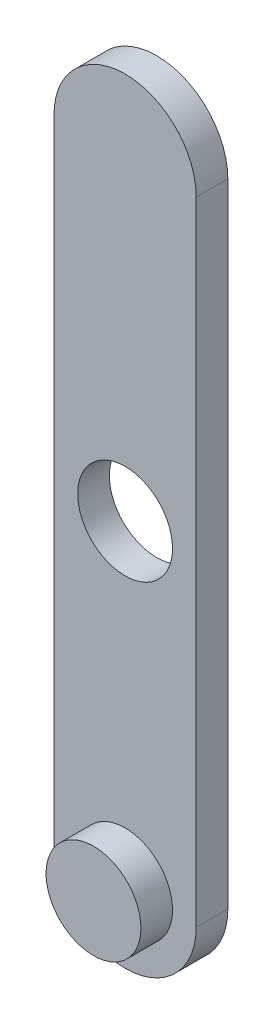
ISO-10303-21;
HEADER;
FILE_DESCRIPTION(('STEP AP214'),'2;1');
FILE_NAME('part.step','',(''),(''),'','','');
FILE_SCHEMA(('AUTOMOTIVE_DESIGN { 1 0 10303 214 1 1 1 1 }'));
ENDSEC;
DATA;
#1=APPLICATION_CONTEXT('core data for automotive mechanical design processes');
#2=APPLICATION_PROTOCOL_DEFINITION('international standard','automotive_design',2000,#1);
#3=PRODUCT_CONTEXT('',#1,'mechanical');
#4=PRODUCT('Part','Part','',(#3));
#5=PRODUCT_RELATED_PRODUCT_CATEGORY('part','',(#4));
#6=PRODUCT_DEFINITION_FORMATION('','',#4);
#7=PRODUCT_DEFINITION_CONTEXT('part definition',#1,'design');
#8=PRODUCT_DEFINITION('design','',#6,#7);
#9=PRODUCT_DEFINITION_SHAPE('','',#8);
#10=(LENGTH_UNIT() NAMED_UNIT(*) SI_UNIT(.MILLI.,.METRE.));
#11=(NAMED_UNIT(*) PLANE_ANGLE_UNIT() SI_UNIT($,.RADIAN.));
#12=(NAMED_UNIT(*) SI_UNIT($,.STERADIAN.) SOLID_ANGLE_UNIT());
#13=UNCERTAINTY_MEASURE_WITH_UNIT(LENGTH_MEASURE(1.E-05),#10,'distance_accuracy_value','');
#14=(GEOMETRIC_REPRESENTATION_CONTEXT(3) GLOBAL_UNCERTAINTY_ASSIGNED_CONTEXT((#13)) GLOBAL_UNIT_ASSIGNED_CONTEXT((#10,
#11,#12)) REPRESENTATION_CONTEXT('',''));
#15=CARTESIAN_POINT('',(0.,0.,0.));
#16=DIRECTION('',(0.,0.,1.));
#17=DIRECTION('',(1.,0.,0.));
#18=AXIS2_PLACEMENT_3D('',#15,#16,#17);
#19=CARTESIAN_POINT('',(0.,-20.,2.));
#20=DIRECTION('',(0.,0.,1.));
#21=DIRECTION('',(1.,0.,0.));
#22=AXIS2_PLACEMENT_3D('',#19,#20,#21);
#23=PLANE('',#22);
#24=CARTESIAN_POINT('',(0.,-19.8046686812946,2.));
#25=DIRECTION('',(0.,0.,1.));
#26=DIRECTION('',(1.,0.,0.));
#27=AXIS2_PLACEMENT_3D('',#24,#25,#26);
#28=CIRCLE('',#27,3.);
#29=CARTESIAN_POINT('',(3.,-19.8046686812946,2.));
#30=VERTEX_POINT('',#29);
#31=EDGE_CURVE('E124',#30,#30,#28,.T.);
#32=ORIENTED_EDGE('',*,*,#31,.F.);
#33=EDGE_LOOP('',(#32));
#34=FACE_BOUND('',#33,.T.);
#35=CARTESIAN_POINT('',(0.,-20.,2.));
#36=DIRECTION('',(0.,0.,1.));
#37=DIRECTION('',(1.,0.,0.));
#38=AXIS2_PLACEMENT_3D('',#35,#36,#37);
#39=CIRCLE('',#38,4.5);
#40=CARTESIAN_POINT('',(-4.5,-20.,2.));
#41=VERTEX_POINT('',#40);
#42=CARTESIAN_POINT('',(4.5,-20.,2.));
#43=VERTEX_POINT('',#42);
#44=EDGE_CURVE('E91',#41,#43,#39,.T.);
#45=ORIENTED_EDGE('',*,*,#44,.T.);
#46=DIRECTION('',(0.,1.,0.));
#47=VECTOR('',#46,1.);
#48=CARTESIAN_POINT('',(4.5,-20.,2.));
#49=LINE('',#48,#47);
#50=CARTESIAN_POINT('',(4.49999999999999,20.,2.));
#51=VERTEX_POINT('',#50);
#52=EDGE_CURVE('E86',#43,#51,#49,.T.);
#53=ORIENTED_EDGE('',*,*,#52,.T.);
#54=CARTESIAN_POINT('',(0.,20.,2.));
#55=DIRECTION('',(0.,0.,1.));
#56=DIRECTION('',(1.,0.,0.));
#57=AXIS2_PLACEMENT_3D('',#54,#55,#56);
#58=CIRCLE('',#57,4.5);
#59=CARTESIAN_POINT('',(-4.50000000000001,20.,2.));
#60=VERTEX_POINT('',#59);
#61=EDGE_CURVE('E89',#51,#60,#58,.T.);
#62=ORIENTED_EDGE('',*,*,#61,.T.);
#63=DIRECTION('',(0.,-1.,0.));
#64=VECTOR('',#63,1.);
#65=CARTESIAN_POINT('',(-4.5,-20.,2.));
#66=LINE('',#65,#64);
#67=EDGE_CURVE('E56',#60,#41,#66,.T.);
#68=ORIENTED_EDGE('',*,*,#67,.T.);
#69=EDGE_LOOP('',(#45,#53,#62,#68));
#70=FACE_BOUND('',#69,.T.);
#71=CARTESIAN_POINT('',(0.,0.,2.));
#72=DIRECTION('',(0.,0.,1.));
#73=DIRECTION('',(1.,0.,0.));
#74=AXIS2_PLACEMENT_3D('',#71,#72,#73);
#75=CIRCLE('',#74,3.);
#76=CARTESIAN_POINT('',(3.,0.,2.));
#77=VERTEX_POINT('',#76);
#78=EDGE_CURVE('E106',#77,#77,#75,.T.);
#79=ORIENTED_EDGE('',*,*,#78,.F.);
#80=EDGE_LOOP('',(#79));
#81=FACE_BOUND('',#80,.T.);
#82=ADVANCED_FACE('F39',(#34,#70,#81),#23,.T.);
#83=CARTESIAN_POINT('',(0.,-20.,0.));
#84=DIRECTION('',(0.,0.,1.));
#85=DIRECTION('',(1.,0.,0.));
#86=AXIS2_PLACEMENT_3D('',#83,#84,#85);
#87=PLANE('',#86);
#88=CARTESIAN_POINT('',(0.,-20.,0.));
#89=DIRECTION('',(0.,0.,1.));
#90=DIRECTION('',(1.,0.,0.));
#91=AXIS2_PLACEMENT_3D('',#88,#89,#90);
#92=CIRCLE('',#91,4.5);
#93=CARTESIAN_POINT('',(-4.5,-20.,0.));
#94=VERTEX_POINT('',#93);
#95=CARTESIAN_POINT('',(4.5,-20.,0.));
#96=VERTEX_POINT('',#95);
#97=EDGE_CURVE('E103',#94,#96,#92,.T.);
#98=ORIENTED_EDGE('',*,*,#97,.F.);
#99=DIRECTION('',(0.,-1.,0.));
#100=VECTOR('',#99,1.);
#101=CARTESIAN_POINT('',(-4.5,-20.,0.));
#102=LINE('',#101,#100);
#103=CARTESIAN_POINT('',(-4.50000000000001,20.,0.));
#104=VERTEX_POINT('',#103);
#105=EDGE_CURVE('E79',#104,#94,#102,.T.);
#106=ORIENTED_EDGE('',*,*,#105,.F.);
#107=CARTESIAN_POINT('',(0.,20.,0.));
#108=DIRECTION('',(0.,0.,1.));
#109=DIRECTION('',(1.,0.,0.));
#110=AXIS2_PLACEMENT_3D('',#107,#108,#109);
#111=CIRCLE('',#110,4.5);
#112=CARTESIAN_POINT('',(4.49999999999999,20.,0.));
#113=VERTEX_POINT('',#112);
#114=EDGE_CURVE('E73',#113,#104,#111,.T.);
#115=ORIENTED_EDGE('',*,*,#114,.F.);
#116=DIRECTION('',(0.,1.,0.));
#117=VECTOR('',#116,1.);
#118=CARTESIAN_POINT('',(4.5,-20.,0.));
#119=LINE('',#118,#117);
#120=EDGE_CURVE('E95',#96,#113,#119,.T.);
#121=ORIENTED_EDGE('',*,*,#120,.F.);
#122=EDGE_LOOP('',(#98,#106,#115,#121));
#123=FACE_BOUND('',#122,.T.);
#124=CARTESIAN_POINT('',(0.,0.,0.));
#125=DIRECTION('',(0.,0.,1.));
#126=DIRECTION('',(1.,0.,0.));
#127=AXIS2_PLACEMENT_3D('',#124,#125,#126);
#128=CIRCLE('',#127,3.);
#129=CARTESIAN_POINT('',(3.,0.,0.));
#130=VERTEX_POINT('',#129);
#131=EDGE_CURVE('E118',#130,#130,#128,.T.);
#132=ORIENTED_EDGE('',*,*,#131,.T.);
#133=EDGE_LOOP('',(#132));
#134=FACE_BOUND('',#133,.T.);
#135=ADVANCED_FACE('F114',(#123,#134),#87,.F.);
#136=CARTESIAN_POINT('',(0.,-20.,2.));
#137=DIRECTION('',(0.,0.,-1.));
#138=DIRECTION('',(-1.,0.,0.));
#139=AXIS2_PLACEMENT_3D('',#136,#137,#138);
#140=CYLINDRICAL_SURFACE('',#139,4.5);
#141=ORIENTED_EDGE('',*,*,#97,.T.);
#142=DIRECTION('',(0.,0.,-1.));
#143=VECTOR('',#142,1.);
#144=CARTESIAN_POINT('',(4.5,-20.,2.));
#145=LINE('',#144,#143);
#146=EDGE_CURVE('E11',#43,#96,#145,.T.);
#147=ORIENTED_EDGE('',*,*,#146,.F.);
#148=ORIENTED_EDGE('',*,*,#44,.F.);
#149=DIRECTION('',(0.,0.,-1.));
#150=VECTOR('',#149,1.);
#151=CARTESIAN_POINT('',(-4.5,-20.,2.));
#152=LINE('',#151,#150);
#153=EDGE_CURVE('E99',#41,#94,#152,.T.);
#154=ORIENTED_EDGE('',*,*,#153,.T.);
#155=EDGE_LOOP('',(#141,#147,#148,#154));
#156=FACE_BOUND('',#155,.T.);
#157=ADVANCED_FACE('F41',(#156),#140,.T.);
#158=CARTESIAN_POINT('',(4.5,-20.,2.));
#159=DIRECTION('',(-1.,0.,0.));
#160=DIRECTION('',(0.,-1.,0.));
#161=AXIS2_PLACEMENT_3D('',#158,#159,#160);
#162=PLANE('',#161);
#163=ORIENTED_EDGE('',*,*,#120,.T.);
#164=DIRECTION('',(0.,0.,-1.));
#165=VECTOR('',#164,1.);
#166=CARTESIAN_POINT('',(4.49999999999999,20.,2.));
#167=LINE('',#166,#165);
#168=EDGE_CURVE('E48',#51,#113,#167,.T.);
#169=ORIENTED_EDGE('',*,*,#168,.F.);
#170=ORIENTED_EDGE('',*,*,#52,.F.);
#171=ORIENTED_EDGE('',*,*,#146,.T.);
#172=EDGE_LOOP('',(#163,#169,#170,#171));
#173=FACE_BOUND('',#172,.T.);
#174=ADVANCED_FACE('F94',(#173),#162,.F.);
#175=CARTESIAN_POINT('',(0.,20.,2.));
#176=DIRECTION('',(0.,0.,-1.));
#177=DIRECTION('',(-1.,0.,0.));
#178=AXIS2_PLACEMENT_3D('',#175,#176,#177);
#179=CYLINDRICAL_SURFACE('',#178,4.5);
#180=ORIENTED_EDGE('',*,*,#114,.T.);
#181=DIRECTION('',(0.,0.,-1.));
#182=VECTOR('',#181,1.);
#183=CARTESIAN_POINT('',(-4.50000000000001,20.,2.));
#184=LINE('',#183,#182);
#185=EDGE_CURVE('E96',#60,#104,#184,.T.);
#186=ORIENTED_EDGE('',*,*,#185,.F.);
#187=ORIENTED_EDGE('',*,*,#61,.F.);
#188=ORIENTED_EDGE('',*,*,#168,.T.);
#189=EDGE_LOOP('',(#180,#186,#187,#188));
#190=FACE_BOUND('',#189,.T.);
#191=ADVANCED_FACE('F97',(#190),#179,.T.);
#192=CARTESIAN_POINT('',(-4.5,-20.,2.));
#193=DIRECTION('',(1.,0.,0.));
#194=DIRECTION('',(0.,1.,0.));
#195=AXIS2_PLACEMENT_3D('',#192,#193,#194);
#196=PLANE('',#195);
#197=ORIENTED_EDGE('',*,*,#105,.T.);
#198=ORIENTED_EDGE('',*,*,#153,.F.);
#199=ORIENTED_EDGE('',*,*,#67,.F.);
#200=ORIENTED_EDGE('',*,*,#185,.T.);
#201=EDGE_LOOP('',(#197,#198,#199,#200));
#202=FACE_BOUND('',#201,.T.);
#203=ADVANCED_FACE('F111',(#202),#196,.F.);
#204=CARTESIAN_POINT('',(0.,0.,2.));
#205=DIRECTION('',(0.,0.,-1.));
#206=DIRECTION('',(-1.,0.,0.));
#207=AXIS2_PLACEMENT_3D('',#204,#205,#206);
#208=CYLINDRICAL_SURFACE('',#207,3.);
#209=ORIENTED_EDGE('',*,*,#78,.T.);
#210=EDGE_LOOP('',(#209));
#211=FACE_BOUND('',#210,.T.);
#212=ORIENTED_EDGE('',*,*,#131,.F.);
#213=EDGE_LOOP('',(#212));
#214=FACE_BOUND('',#213,.T.);
#215=ADVANCED_FACE('F135',(#211,#214),#208,.F.);
#216=CARTESIAN_POINT('',(0.,-19.8046686812946,4.));
#217=DIRECTION('',(0.,0.,-1.));
#218=DIRECTION('',(-1.,0.,0.));
#219=AXIS2_PLACEMENT_3D('',#216,#217,#218);
#220=CYLINDRICAL_SURFACE('',#219,3.);
#221=CARTESIAN_POINT('',(0.,-19.8046686812946,4.));
#222=DIRECTION('',(0.,0.,1.));
#223=DIRECTION('',(1.,0.,0.));
#224=AXIS2_PLACEMENT_3D('',#221,#222,#223);
#225=CIRCLE('',#224,3.);
#226=CARTESIAN_POINT('',(3.,-19.8046686812946,4.));
#227=VERTEX_POINT('',#226);
#228=EDGE_CURVE('E121',#227,#227,#225,.T.);
#229=ORIENTED_EDGE('',*,*,#228,.F.);
#230=EDGE_LOOP('',(#229));
#231=FACE_BOUND('',#230,.T.);
#232=ORIENTED_EDGE('',*,*,#31,.T.);
#233=EDGE_LOOP('',(#232));
#234=FACE_BOUND('',#233,.T.);
#235=ADVANCED_FACE('F132',(#231,#234),#220,.T.);
#236=CARTESIAN_POINT('',(0.,-19.8046686812946,4.));
#237=DIRECTION('',(0.,0.,1.));
#238=DIRECTION('',(1.,0.,0.));
#239=AXIS2_PLACEMENT_3D('',#236,#237,#238);
#240=PLANE('',#239);
#241=ORIENTED_EDGE('',*,*,#228,.T.);
#242=EDGE_LOOP('',(#241));
#243=FACE_BOUND('',#242,.T.);
#244=ADVANCED_FACE('F130',(#243),#240,.T.);
#245=CLOSED_SHELL('',(#82,#135,#157,#174,#191,#203,#215,#235,#244));
#246=MANIFOLD_SOLID_BREP('B2',#245);
#247=ADVANCED_BREP_SHAPE_REPRESENTATION('',(#18,#246),#14);
#248=SHAPE_DEFINITION_REPRESENTATION(#9,#247);
ENDSEC;
END-ISO-10303-21;
